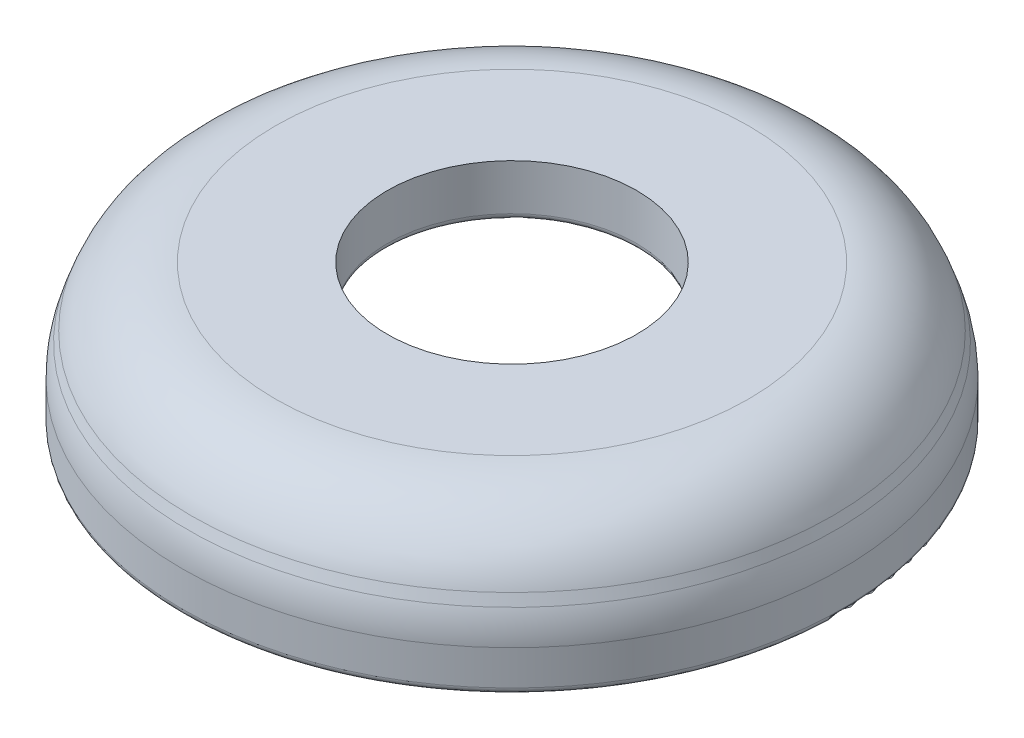
ISO-10303-21;
HEADER;
FILE_DESCRIPTION(('STEP AP214'),'2;1');
FILE_NAME('part.step','',(''),(''),'','','');
FILE_SCHEMA(('AUTOMOTIVE_DESIGN { 1 0 10303 214 1 1 1 1 }'));
ENDSEC;
DATA;
#1=APPLICATION_CONTEXT('core data for automotive mechanical design processes');
#2=APPLICATION_PROTOCOL_DEFINITION('international standard','automotive_design',2000,#1);
#3=PRODUCT_CONTEXT('',#1,'mechanical');
#4=PRODUCT('Part','Part','',(#3));
#5=PRODUCT_RELATED_PRODUCT_CATEGORY('part','',(#4));
#6=PRODUCT_DEFINITION_FORMATION('','',#4);
#7=PRODUCT_DEFINITION_CONTEXT('part definition',#1,'design');
#8=PRODUCT_DEFINITION('design','',#6,#7);
#9=PRODUCT_DEFINITION_SHAPE('','',#8);
#10=(LENGTH_UNIT() NAMED_UNIT(*) SI_UNIT(.MILLI.,.METRE.));
#11=(NAMED_UNIT(*) PLANE_ANGLE_UNIT() SI_UNIT($,.RADIAN.));
#12=(NAMED_UNIT(*) SI_UNIT($,.STERADIAN.) SOLID_ANGLE_UNIT());
#13=UNCERTAINTY_MEASURE_WITH_UNIT(LENGTH_MEASURE(1.E-05),#10,'distance_accuracy_value','');
#14=(GEOMETRIC_REPRESENTATION_CONTEXT(3) GLOBAL_UNCERTAINTY_ASSIGNED_CONTEXT((#13)) GLOBAL_UNIT_ASSIGNED_CONTEXT((#10,
#11,#12)) REPRESENTATION_CONTEXT('',''));
#15=CARTESIAN_POINT('',(0.,0.,0.));
#16=DIRECTION('',(0.,0.,1.));
#17=DIRECTION('',(1.,0.,0.));
#18=AXIS2_PLACEMENT_3D('',#15,#16,#17);
#19=CARTESIAN_POINT('',(0.,-4.99328293761699,0.));
#20=DIRECTION('',(0.,-1.,0.));
#21=DIRECTION('',(0.,0.,-1.));
#22=AXIS2_PLACEMENT_3D('',#19,#20,#21);
#23=CYLINDRICAL_SURFACE('',#22,4.75);
#24=CARTESIAN_POINT('',(0.,2.5,0.));
#25=DIRECTION('',(0.,-1.,0.));
#26=DIRECTION('',(0.,0.,-1.));
#27=AXIS2_PLACEMENT_3D('',#24,#25,#26);
#28=CIRCLE('',#27,4.75);
#29=CARTESIAN_POINT('',(0.,2.5,-4.75));
#30=VERTEX_POINT('',#29);
#31=EDGE_CURVE('E10',#30,#30,#28,.T.);
#32=ORIENTED_EDGE('',*,*,#31,.T.);
#33=EDGE_LOOP('',(#32));
#34=FACE_BOUND('',#33,.T.);
#35=CARTESIAN_POINT('',(0.,4.25,0.));
#36=DIRECTION('',(0.,-1.,0.));
#37=DIRECTION('',(0.,0.,-1.));
#38=AXIS2_PLACEMENT_3D('',#35,#36,#37);
#39=CIRCLE('',#38,4.75);
#40=CARTESIAN_POINT('',(0.,4.25,-4.75));
#41=VERTEX_POINT('',#40);
#42=EDGE_CURVE('E90',#41,#41,#39,.T.);
#43=ORIENTED_EDGE('',*,*,#42,.F.);
#44=EDGE_LOOP('',(#43));
#45=FACE_BOUND('',#44,.T.);
#46=ADVANCED_FACE('F34',(#34,#45),#23,.F.);
#47=CARTESIAN_POINT('',(0.,2.5,0.));
#48=DIRECTION('',(0.,-1.,0.));
#49=DIRECTION('',(0.,0.,-1.));
#50=AXIS2_PLACEMENT_3D('',#47,#48,#49);
#51=TOROIDAL_SURFACE('',#50,5.,0.25);
#52=CARTESIAN_POINT('',(0.,2.25,0.));
#53=DIRECTION('',(0.,-1.,0.));
#54=DIRECTION('',(0.,0.,-1.));
#55=AXIS2_PLACEMENT_3D('',#52,#53,#54);
#56=CIRCLE('',#55,5.);
#57=CARTESIAN_POINT('',(0.,2.25,-5.));
#58=VERTEX_POINT('',#57);
#59=EDGE_CURVE('E41',#58,#58,#56,.T.);
#60=ORIENTED_EDGE('',*,*,#59,.T.);
#61=EDGE_LOOP('',(#60));
#62=FACE_BOUND('',#61,.T.);
#63=ORIENTED_EDGE('',*,*,#31,.F.);
#64=EDGE_LOOP('',(#63));
#65=FACE_BOUND('',#64,.T.);
#66=ADVANCED_FACE('F98',(#62,#65),#51,.T.);
#67=CARTESIAN_POINT('',(9.75,2.25,0.));
#68=DIRECTION('',(0.,-1.,0.));
#69=DIRECTION('',(0.,0.,-1.));
#70=AXIS2_PLACEMENT_3D('',#67,#68,#69);
#71=PLANE('',#70);
#72=CARTESIAN_POINT('',(0.,2.25,0.));
#73=DIRECTION('',(0.,-1.,0.));
#74=DIRECTION('',(0.,0.,-1.));
#75=AXIS2_PLACEMENT_3D('',#72,#73,#74);
#76=CIRCLE('',#75,9.75);
#77=CARTESIAN_POINT('',(0.,2.25,-9.75));
#78=VERTEX_POINT('',#77);
#79=EDGE_CURVE('E47',#78,#78,#76,.T.);
#80=ORIENTED_EDGE('',*,*,#79,.T.);
#81=EDGE_LOOP('',(#80));
#82=FACE_BOUND('',#81,.T.);
#83=ORIENTED_EDGE('',*,*,#59,.F.);
#84=EDGE_LOOP('',(#83));
#85=FACE_BOUND('',#84,.T.);
#86=ADVANCED_FACE('F102',(#82,#85),#71,.T.);
#87=CARTESIAN_POINT('',(0.,1.89601799671938,0.));
#88=DIRECTION('',(0.,-1.,0.));
#89=DIRECTION('',(0.,0.,-1.));
#90=AXIS2_PLACEMENT_3D('',#87,#88,#89);
#91=TOROIDAL_SURFACE('',#90,9.75,0.353982003280621);
#92=CARTESIAN_POINT('',(0.,2.01439306362969,0.));
#93=DIRECTION('',(0.,-1.,0.));
#94=DIRECTION('',(0.,0.,-1.));
#95=AXIS2_PLACEMENT_3D('',#92,#93,#94);
#96=CIRCLE('',#95,10.0836024612927);
#97=CARTESIAN_POINT('',(0.,2.01439306362969,-10.0836024612927));
#98=VERTEX_POINT('',#97);
#99=EDGE_CURVE('E53',#98,#98,#96,.T.);
#100=ORIENTED_EDGE('',*,*,#99,.T.);
#101=EDGE_LOOP('',(#100));
#102=FACE_BOUND('',#101,.T.);
#103=ORIENTED_EDGE('',*,*,#79,.F.);
#104=EDGE_LOOP('',(#103));
#105=FACE_BOUND('',#104,.T.);
#106=ADVANCED_FACE('F106',(#102,#105),#91,.F.);
#107=CARTESIAN_POINT('',(0.,2.01439306362969,0.));
#108=DIRECTION('',(0.,-1.,0.));
#109=DIRECTION('',(0.,0.,-1.));
#110=AXIS2_PLACEMENT_3D('',#107,#108,#109);
#111=CONICAL_SURFACE('',#110,10.0836024612927,0.340978953496349);
#112=CARTESIAN_POINT('',(0.,-0.999097171214312,0.));
#113=DIRECTION('',(0.,-1.,0.));
#114=DIRECTION('',(0.,0.,-1.));
#115=AXIS2_PLACEMENT_3D('',#112,#113,#114);
#116=CIRCLE('',#115,11.1529054478502);
#117=CARTESIAN_POINT('',(0.,-0.999097171214312,-11.1529054478502));
#118=VERTEX_POINT('',#117);
#119=EDGE_CURVE('E59',#118,#118,#116,.T.);
#120=ORIENTED_EDGE('',*,*,#119,.T.);
#121=EDGE_LOOP('',(#120));
#122=FACE_BOUND('',#121,.T.);
#123=ORIENTED_EDGE('',*,*,#99,.F.);
#124=EDGE_LOOP('',(#123));
#125=FACE_BOUND('',#124,.T.);
#126=ADVANCED_FACE('F113',(#122,#125),#111,.F.);
#127=CARTESIAN_POINT('',(0.,-0.915494709921622,0.));
#128=DIRECTION('',(0.,-1.,0.));
#129=DIRECTION('',(0.,0.,-1.));
#130=AXIS2_PLACEMENT_3D('',#127,#128,#129);
#131=TOROIDAL_SURFACE('',#130,11.3885123842206,0.25);
#132=CARTESIAN_POINT('',(0.,-1.16549470992162,0.));
#133=DIRECTION('',(0.,-1.,0.));
#134=DIRECTION('',(0.,0.,-1.));
#135=AXIS2_PLACEMENT_3D('',#132,#133,#134);
#136=CIRCLE('',#135,11.3885123842206);
#137=CARTESIAN_POINT('',(0.,-1.16549470992162,-11.3885123842206));
#138=VERTEX_POINT('',#137);
#139=EDGE_CURVE('E63',#138,#138,#136,.T.);
#140=ORIENTED_EDGE('',*,*,#139,.T.);
#141=EDGE_LOOP('',(#140));
#142=FACE_BOUND('',#141,.T.);
#143=ORIENTED_EDGE('',*,*,#119,.F.);
#144=EDGE_LOOP('',(#143));
#145=FACE_BOUND('',#144,.T.);
#146=ADVANCED_FACE('F117',(#142,#145),#131,.T.);
#147=CARTESIAN_POINT('',(11.3885123842206,-1.16549470992162,0.));
#148=DIRECTION('',(0.,-1.,0.));
#149=DIRECTION('',(0.,0.,-1.));
#150=AXIS2_PLACEMENT_3D('',#147,#148,#149);
#151=PLANE('',#150);
#152=CARTESIAN_POINT('',(0.,-1.16549470992162,0.));
#153=DIRECTION('',(0.,-1.,0.));
#154=DIRECTION('',(0.,0.,-1.));
#155=AXIS2_PLACEMENT_3D('',#152,#153,#154);
#156=CIRCLE('',#155,12.306974260328);
#157=CARTESIAN_POINT('',(0.,-1.16549470992162,-12.306974260328));
#158=VERTEX_POINT('',#157);
#159=EDGE_CURVE('E67',#158,#158,#156,.T.);
#160=ORIENTED_EDGE('',*,*,#159,.T.);
#161=EDGE_LOOP('',(#160));
#162=FACE_BOUND('',#161,.T.);
#163=ORIENTED_EDGE('',*,*,#139,.F.);
#164=EDGE_LOOP('',(#163));
#165=FACE_BOUND('',#164,.T.);
#166=ADVANCED_FACE('F121',(#162,#165),#151,.T.);
#167=CARTESIAN_POINT('',(0.,-0.915494709921621,0.));
#168=DIRECTION('',(0.,-1.,0.));
#169=DIRECTION('',(0.,0.,-1.));
#170=AXIS2_PLACEMENT_3D('',#167,#168,#169);
#171=TOROIDAL_SURFACE('',#170,12.306974260328,0.25);
#172=CARTESIAN_POINT('',(0.,-0.915494709921619,0.));
#173=DIRECTION('',(0.,-1.,0.));
#174=DIRECTION('',(0.,0.,-1.));
#175=AXIS2_PLACEMENT_3D('',#172,#173,#174);
#176=CIRCLE('',#175,12.556974260328);
#177=CARTESIAN_POINT('',(0.,-0.915494709921619,-12.556974260328));
#178=VERTEX_POINT('',#177);
#179=EDGE_CURVE('E71',#178,#178,#176,.T.);
#180=ORIENTED_EDGE('',*,*,#179,.T.);
#181=EDGE_LOOP('',(#180));
#182=FACE_BOUND('',#181,.T.);
#183=ORIENTED_EDGE('',*,*,#159,.F.);
#184=EDGE_LOOP('',(#183));
#185=FACE_BOUND('',#184,.T.);
#186=ADVANCED_FACE('F125',(#182,#185),#171,.T.);
#187=CARTESIAN_POINT('',(0.,-4.99328293761699,0.));
#188=DIRECTION('',(0.,-1.,0.));
#189=DIRECTION('',(0.,0.,-1.));
#190=AXIS2_PLACEMENT_3D('',#187,#188,#189);
#191=CYLINDRICAL_SURFACE('',#190,12.556974260328);
#192=CARTESIAN_POINT('',(0.,0.413542553313164,0.));
#193=DIRECTION('',(0.,-1.,0.));
#194=DIRECTION('',(0.,0.,-1.));
#195=AXIS2_PLACEMENT_3D('',#192,#193,#194);
#196=CIRCLE('',#195,12.556974260328);
#197=CARTESIAN_POINT('',(0.,0.413542553313164,-12.556974260328));
#198=VERTEX_POINT('',#197);
#199=EDGE_CURVE('E75',#198,#198,#196,.T.);
#200=ORIENTED_EDGE('',*,*,#199,.T.);
#201=EDGE_LOOP('',(#200));
#202=FACE_BOUND('',#201,.T.);
#203=ORIENTED_EDGE('',*,*,#179,.F.);
#204=EDGE_LOOP('',(#203));
#205=FACE_BOUND('',#204,.T.);
#206=ADVANCED_FACE('F129',(#202,#205),#191,.T.);
#207=CARTESIAN_POINT('',(0.,0.413542553313154,0.));
#208=DIRECTION('',(0.,-1.,0.));
#209=DIRECTION('',(0.,0.,-1.));
#210=AXIS2_PLACEMENT_3D('',#207,#208,#209);
#211=TOROIDAL_SURFACE('',#210,9.00724419151133,3.54973006881663);
#212=CARTESIAN_POINT('',(0.,1.60060723602414,0.));
#213=DIRECTION('',(0.,-1.,0.));
#214=DIRECTION('',(0.,0.,-1.));
#215=AXIS2_PLACEMENT_3D('',#212,#213,#214);
#216=CIRCLE('',#215,12.3526082973332);
#217=CARTESIAN_POINT('',(0.,1.60060723602414,-12.3526082973332));
#218=VERTEX_POINT('',#217);
#219=EDGE_CURVE('E79',#218,#218,#216,.T.);
#220=ORIENTED_EDGE('',*,*,#219,.T.);
#221=EDGE_LOOP('',(#220));
#222=FACE_BOUND('',#221,.T.);
#223=ORIENTED_EDGE('',*,*,#199,.F.);
#224=EDGE_LOOP('',(#223));
#225=FACE_BOUND('',#224,.T.);
#226=ADVANCED_FACE('F133',(#222,#225),#211,.T.);
#227=CARTESIAN_POINT('',(0.,1.60060723602414,0.));
#228=DIRECTION('',(0.,-1.,0.));
#229=DIRECTION('',(0.,0.,-1.));
#230=AXIS2_PLACEMENT_3D('',#227,#228,#229);
#231=CONICAL_SURFACE('',#230,12.3526082973332,0.340978953496348);
#232=CARTESIAN_POINT('',(0.,1.99169458504485,0.));
#233=DIRECTION('',(0.,-1.,0.));
#234=DIRECTION('',(0.,0.,-1.));
#235=AXIS2_PLACEMENT_3D('',#232,#233,#234);
#236=CIRCLE('',#235,12.2138353670355);
#237=CARTESIAN_POINT('',(0.,1.99169458504485,-12.2138353670355));
#238=VERTEX_POINT('',#237);
#239=EDGE_CURVE('E83',#238,#238,#236,.T.);
#240=ORIENTED_EDGE('',*,*,#239,.T.);
#241=EDGE_LOOP('',(#240));
#242=FACE_BOUND('',#241,.T.);
#243=ORIENTED_EDGE('',*,*,#219,.F.);
#244=EDGE_LOOP('',(#243));
#245=FACE_BOUND('',#244,.T.);
#246=ADVANCED_FACE('F137',(#242,#245),#231,.T.);
#247=CARTESIAN_POINT('',(0.,0.857063072417977,0.));
#248=DIRECTION('',(0.,-1.,0.));
#249=DIRECTION('',(0.,0.,-1.));
#250=AXIS2_PLACEMENT_3D('',#247,#248,#249);
#251=TOROIDAL_SURFACE('',#250,9.01623746781432,3.39293692758202);
#252=CARTESIAN_POINT('',(0.,4.25,0.));
#253=DIRECTION('',(0.,-1.,0.));
#254=DIRECTION('',(0.,0.,-1.));
#255=AXIS2_PLACEMENT_3D('',#252,#253,#254);
#256=CIRCLE('',#255,9.01623746781432);
#257=CARTESIAN_POINT('',(0.,4.25,-9.01623746781432));
#258=VERTEX_POINT('',#257);
#259=EDGE_CURVE('E87',#258,#258,#256,.T.);
#260=ORIENTED_EDGE('',*,*,#259,.T.);
#261=EDGE_LOOP('',(#260));
#262=FACE_BOUND('',#261,.T.);
#263=ORIENTED_EDGE('',*,*,#239,.F.);
#264=EDGE_LOOP('',(#263));
#265=FACE_BOUND('',#264,.T.);
#266=ADVANCED_FACE('F141',(#262,#265),#251,.T.);
#267=CARTESIAN_POINT('',(4.75,4.25,0.));
#268=DIRECTION('',(0.,1.,0.));
#269=DIRECTION('',(0.,0.,1.));
#270=AXIS2_PLACEMENT_3D('',#267,#268,#269);
#271=PLANE('',#270);
#272=ORIENTED_EDGE('',*,*,#42,.T.);
#273=EDGE_LOOP('',(#272));
#274=FACE_BOUND('',#273,.T.);
#275=ORIENTED_EDGE('',*,*,#259,.F.);
#276=EDGE_LOOP('',(#275));
#277=FACE_BOUND('',#276,.T.);
#278=ADVANCED_FACE('F94',(#274,#277),#271,.T.);
#279=CLOSED_SHELL('',(#46,#66,#86,#106,#126,#146,#166,#186,#206,#226,#246,#266,#278));
#280=MANIFOLD_SOLID_BREP('B2',#279);
#281=ADVANCED_BREP_SHAPE_REPRESENTATION('',(#18,#280),#14);
#282=SHAPE_DEFINITION_REPRESENTATION(#9,#281);
ENDSEC;
END-ISO-10303-21;
